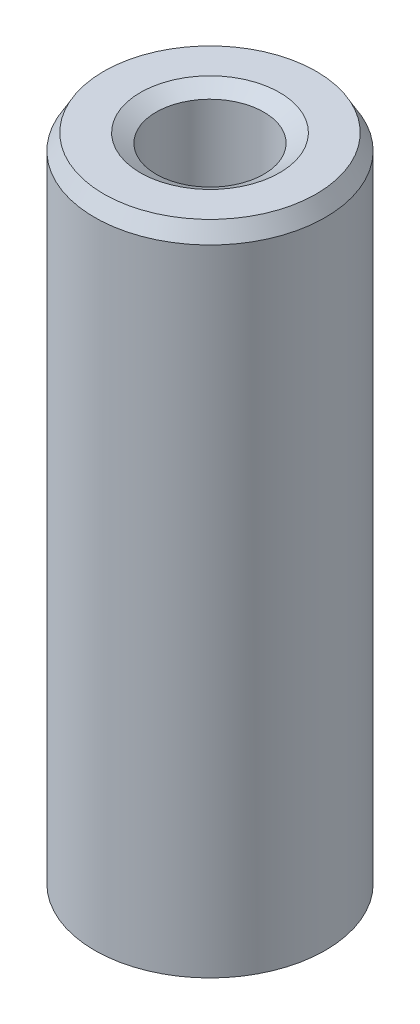
ISO-10303-21;
HEADER;
FILE_DESCRIPTION(('STEP AP214'),'2;1');
FILE_NAME('part.step','',(''),(''),'','','');
FILE_SCHEMA(('AUTOMOTIVE_DESIGN { 1 0 10303 214 1 1 1 1 }'));
ENDSEC;
DATA;
#1=APPLICATION_CONTEXT('core data for automotive mechanical design processes');
#2=APPLICATION_PROTOCOL_DEFINITION('international standard','automotive_design',2000,#1);
#3=PRODUCT_CONTEXT('',#1,'mechanical');
#4=PRODUCT('Part','Part','',(#3));
#5=PRODUCT_RELATED_PRODUCT_CATEGORY('part','',(#4));
#6=PRODUCT_DEFINITION_FORMATION('','',#4);
#7=PRODUCT_DEFINITION_CONTEXT('part definition',#1,'design');
#8=PRODUCT_DEFINITION('design','',#6,#7);
#9=PRODUCT_DEFINITION_SHAPE('','',#8);
#10=(LENGTH_UNIT() NAMED_UNIT(*) SI_UNIT(.MILLI.,.METRE.));
#11=(NAMED_UNIT(*) PLANE_ANGLE_UNIT() SI_UNIT($,.RADIAN.));
#12=(NAMED_UNIT(*) SI_UNIT($,.STERADIAN.) SOLID_ANGLE_UNIT());
#13=UNCERTAINTY_MEASURE_WITH_UNIT(LENGTH_MEASURE(1.E-05),#10,'distance_accuracy_value','');
#14=(GEOMETRIC_REPRESENTATION_CONTEXT(3) GLOBAL_UNCERTAINTY_ASSIGNED_CONTEXT((#13)) GLOBAL_UNIT_ASSIGNED_CONTEXT((#10,
#11,#12)) REPRESENTATION_CONTEXT('',''));
#15=CARTESIAN_POINT('',(0.,0.,0.));
#16=DIRECTION('',(0.,0.,1.));
#17=DIRECTION('',(1.,0.,0.));
#18=AXIS2_PLACEMENT_3D('',#15,#16,#17);
#19=CARTESIAN_POINT('',(0.,28.5897561226494,0.));
#20=DIRECTION('',(0.,-1.,0.));
#21=DIRECTION('',(0.,0.,-1.));
#22=AXIS2_PLACEMENT_3D('',#19,#20,#21);
#23=CYLINDRICAL_SURFACE('',#22,5.);
#24=CARTESIAN_POINT('',(0.,0.394438370758168,0.));
#25=DIRECTION('',(0.,1.,0.));
#26=DIRECTION('',(0.,0.,1.));
#27=AXIS2_PLACEMENT_3D('',#24,#25,#26);
#28=CIRCLE('',#27,5.);
#29=CARTESIAN_POINT('',(0.,0.394438370758168,5.));
#30=VERTEX_POINT('',#29);
#31=EDGE_CURVE('E10',#30,#30,#28,.T.);
#32=ORIENTED_EDGE('',*,*,#31,.T.);
#33=EDGE_LOOP('',(#32));
#34=FACE_BOUND('',#33,.T.);
#35=CARTESIAN_POINT('',(0.,27.9065688240416,0.));
#36=DIRECTION('',(0.,1.,0.));
#37=DIRECTION('',(0.,0.,1.));
#38=AXIS2_PLACEMENT_3D('',#35,#36,#37);
#39=CIRCLE('',#38,5.);
#40=CARTESIAN_POINT('',(0.,27.9065688240416,-5.));
#41=VERTEX_POINT('',#40);
#42=EDGE_CURVE('E50',#41,#41,#39,.F.);
#43=ORIENTED_EDGE('',*,*,#42,.T.);
#44=EDGE_LOOP('',(#43));
#45=FACE_BOUND('',#44,.T.);
#46=ADVANCED_FACE('F39',(#34,#45),#23,.T.);
#47=CARTESIAN_POINT('',(0.,28.5897561226494,0.));
#48=DIRECTION('',(0.,1.,0.));
#49=DIRECTION('',(0.,0.,1.));
#50=AXIS2_PLACEMENT_3D('',#47,#48,#49);
#51=PLANE('',#50);
#52=CARTESIAN_POINT('',(0.,28.5897561226494,0.));
#53=DIRECTION('',(0.,1.,0.));
#54=DIRECTION('',(0.,0.,1.));
#55=AXIS2_PLACEMENT_3D('',#52,#53,#54);
#56=CIRCLE('',#55,3.01723917151664);
#57=CARTESIAN_POINT('',(0.,28.5897561226494,3.01723917151664));
#58=VERTEX_POINT('',#57);
#59=EDGE_CURVE('E58',#58,#58,#56,.F.);
#60=ORIENTED_EDGE('',*,*,#59,.T.);
#61=EDGE_LOOP('',(#60));
#62=FACE_BOUND('',#61,.T.);
#63=CARTESIAN_POINT('',(0.,28.5897561226494,0.));
#64=DIRECTION('',(0.,1.,0.));
#65=DIRECTION('',(0.,0.,1.));
#66=AXIS2_PLACEMENT_3D('',#63,#64,#65);
#67=CIRCLE('',#66,4.60556162924183);
#68=CARTESIAN_POINT('',(0.,28.5897561226494,-4.60556162924183));
#69=VERTEX_POINT('',#68);
#70=EDGE_CURVE('E61',#69,#69,#67,.T.);
#71=ORIENTED_EDGE('',*,*,#70,.T.);
#72=EDGE_LOOP('',(#71));
#73=FACE_BOUND('',#72,.T.);
#74=ADVANCED_FACE('F88',(#62,#73),#51,.T.);
#75=CARTESIAN_POINT('',(0.,0.,0.));
#76=DIRECTION('',(0.,1.,0.));
#77=DIRECTION('',(0.,0.,1.));
#78=AXIS2_PLACEMENT_3D('',#75,#76,#77);
#79=PLANE('',#78);
#80=CARTESIAN_POINT('',(0.,0.,0.));
#81=DIRECTION('',(0.,1.,0.));
#82=DIRECTION('',(0.,0.,1.));
#83=AXIS2_PLACEMENT_3D('',#80,#81,#82);
#84=CIRCLE('',#83,2.72849024366697);
#85=CARTESIAN_POINT('',(0.,0.,2.72849024366697));
#86=VERTEX_POINT('',#85);
#87=EDGE_CURVE('E51',#86,#86,#84,.T.);
#88=ORIENTED_EDGE('',*,*,#87,.T.);
#89=EDGE_LOOP('',(#88));
#90=FACE_BOUND('',#89,.T.);
#91=CARTESIAN_POINT('',(0.,0.,0.));
#92=DIRECTION('',(0.,1.,0.));
#93=DIRECTION('',(0.,0.,1.));
#94=AXIS2_PLACEMENT_3D('',#91,#92,#93);
#95=CIRCLE('',#94,4.31681270139216);
#96=CARTESIAN_POINT('',(0.,0.,4.31681270139216));
#97=VERTEX_POINT('',#96);
#98=EDGE_CURVE('E54',#97,#97,#95,.F.);
#99=ORIENTED_EDGE('',*,*,#98,.T.);
#100=EDGE_LOOP('',(#99));
#101=FACE_BOUND('',#100,.T.);
#102=ADVANCED_FACE('F83',(#90,#101),#79,.F.);
#103=CARTESIAN_POINT('',(0.,28.5897561226494,0.));
#104=DIRECTION('',(0.,-1.,0.));
#105=DIRECTION('',(0.,0.,-1.));
#106=AXIS2_PLACEMENT_3D('',#103,#104,#105);
#107=CYLINDRICAL_SURFACE('',#106,2.3340518729088);
#108=CARTESIAN_POINT('',(0.,28.1953177518913,0.));
#109=DIRECTION('',(0.,1.,0.));
#110=DIRECTION('',(0.,0.,1.));
#111=AXIS2_PLACEMENT_3D('',#108,#109,#110);
#112=CIRCLE('',#111,2.3340518729088);
#113=CARTESIAN_POINT('',(0.,28.1953177518913,2.3340518729088));
#114=VERTEX_POINT('',#113);
#115=EDGE_CURVE('E67',#114,#114,#112,.T.);
#116=ORIENTED_EDGE('',*,*,#115,.T.);
#117=EDGE_LOOP('',(#116));
#118=FACE_BOUND('',#117,.T.);
#119=CARTESIAN_POINT('',(0.,0.683187298607842,0.));
#120=DIRECTION('',(0.,1.,0.));
#121=DIRECTION('',(0.,0.,1.));
#122=AXIS2_PLACEMENT_3D('',#119,#120,#121);
#123=CIRCLE('',#122,2.3340518729088);
#124=CARTESIAN_POINT('',(0.,0.683187298607842,2.3340518729088));
#125=VERTEX_POINT('',#124);
#126=EDGE_CURVE('E69',#125,#125,#123,.F.);
#127=ORIENTED_EDGE('',*,*,#126,.T.);
#128=EDGE_LOOP('',(#127));
#129=FACE_BOUND('',#128,.T.);
#130=ADVANCED_FACE('F71',(#118,#129),#107,.F.);
#131=CARTESIAN_POINT('',(0.,28.1953177518913,0.));
#132=DIRECTION('',(0.,1.,0.));
#133=DIRECTION('',(0.,0.,1.));
#134=AXIS2_PLACEMENT_3D('',#131,#132,#133);
#135=CONICAL_SURFACE('',#134,2.3340518729088,1.0471975511966);
#136=ORIENTED_EDGE('',*,*,#59,.F.);
#137=EDGE_LOOP('',(#136));
#138=FACE_BOUND('',#137,.T.);
#139=ORIENTED_EDGE('',*,*,#115,.F.);
#140=EDGE_LOOP('',(#139));
#141=FACE_BOUND('',#140,.T.);
#142=ADVANCED_FACE('F77',(#138,#141),#135,.F.);
#143=CARTESIAN_POINT('',(0.,0.,0.));
#144=DIRECTION('',(0.,-1.,0.));
#145=DIRECTION('',(0.,0.,-1.));
#146=AXIS2_PLACEMENT_3D('',#143,#144,#145);
#147=CONICAL_SURFACE('',#146,2.72849024366697,0.523598775598297);
#148=ORIENTED_EDGE('',*,*,#126,.F.);
#149=EDGE_LOOP('',(#148));
#150=FACE_BOUND('',#149,.T.);
#151=ORIENTED_EDGE('',*,*,#87,.F.);
#152=EDGE_LOOP('',(#151));
#153=FACE_BOUND('',#152,.T.);
#154=ADVANCED_FACE('F73',(#150,#153),#147,.F.);
#155=CARTESIAN_POINT('',(0.,0.394438370758168,0.));
#156=DIRECTION('',(0.,1.,0.));
#157=DIRECTION('',(0.,0.,1.));
#158=AXIS2_PLACEMENT_3D('',#155,#156,#157);
#159=CONICAL_SURFACE('',#158,5.,1.0471975511966);
#160=ORIENTED_EDGE('',*,*,#98,.F.);
#161=EDGE_LOOP('',(#160));
#162=FACE_BOUND('',#161,.T.);
#163=ORIENTED_EDGE('',*,*,#31,.F.);
#164=EDGE_LOOP('',(#163));
#165=FACE_BOUND('',#164,.T.);
#166=ADVANCED_FACE('F76',(#162,#165),#159,.T.);
#167=CARTESIAN_POINT('',(0.,28.5897561226494,0.));
#168=DIRECTION('',(0.,-1.,0.));
#169=DIRECTION('',(0.,0.,-1.));
#170=AXIS2_PLACEMENT_3D('',#167,#168,#169);
#171=CONICAL_SURFACE('',#170,4.60556162924183,0.523598775598294);
#172=CARTESIAN_POINT('',(0.,27.9065688240416,-5.));
#173=CARTESIAN_POINT('',(0.,27.9136853584021,-4.99589126697127));
#174=CARTESIAN_POINT('',(0.,27.9208018927626,-4.99178253394254));
#175=CARTESIAN_POINT('',(0.,27.9350349614836,-4.98356506788508));
#176=CARTESIAN_POINT('',(0.,27.9421514958441,-4.97945633485635));
#177=CARTESIAN_POINT('',(0.,27.9563845645651,-4.97123886879888));
#178=CARTESIAN_POINT('',(0.,27.9635010989256,-4.96713013577015));
#179=CARTESIAN_POINT('',(0.,27.9777341676466,-4.95891266971269));
#180=CARTESIAN_POINT('',(0.,27.9848507020071,-4.95480393668396));
#181=CARTESIAN_POINT('',(0.,27.9990837707281,-4.9465864706265));
#182=CARTESIAN_POINT('',(0.,28.0062003050886,-4.94247773759777));
#183=CARTESIAN_POINT('',(0.,28.0204333738096,-4.93426027154031));
#184=CARTESIAN_POINT('',(0.,28.0275499081701,-4.93015153851157));
#185=CARTESIAN_POINT('',(0.,28.0417829768911,-4.92193407245411));
#186=CARTESIAN_POINT('',(0.,28.0488995112516,-4.91782533942538));
#187=CARTESIAN_POINT('',(0.,28.0631325799725,-4.90960787336792));
#188=CARTESIAN_POINT('',(0.,28.0702491143331,-4.90549914033919));
#189=CARTESIAN_POINT('',(0.,28.084482183054,-4.89728167428173));
#190=CARTESIAN_POINT('',(0.,28.0915987174145,-4.893172941253));
#191=CARTESIAN_POINT('',(0.,28.1058317861355,-4.88495547519554));
#192=CARTESIAN_POINT('',(0.,28.112948320496,-4.8808467421668));
#193=CARTESIAN_POINT('',(0.,28.127181389217,-4.87262927610934));
#194=CARTESIAN_POINT('',(0.,28.1342979235775,-4.86852054308061));
#195=CARTESIAN_POINT('',(0.,28.1485309922985,-4.86030307702315));
#196=CARTESIAN_POINT('',(0.,28.155647526659,-4.85619434399442));
#197=CARTESIAN_POINT('',(0.,28.16988059538,-4.84797687793696));
#198=CARTESIAN_POINT('',(0.,28.1769971297405,-4.84386814490823));
#199=CARTESIAN_POINT('',(0.,28.1912301984615,-4.83565067885076));
#200=CARTESIAN_POINT('',(0.,28.198346732822,-4.83154194582203));
#201=CARTESIAN_POINT('',(0.,28.212579801543,-4.82332447976457));
#202=CARTESIAN_POINT('',(0.,28.2196963359035,-4.81921574673584));
#203=CARTESIAN_POINT('',(0.,28.2339294046245,-4.81099828067838));
#204=CARTESIAN_POINT('',(0.,28.241045938985,-4.80688954764965));
#205=CARTESIAN_POINT('',(0.,28.255279007706,-4.79867208159219));
#206=CARTESIAN_POINT('',(0.,28.2623955420665,-4.79456334856345));
#207=CARTESIAN_POINT('',(0.,28.2766286107875,-4.78634588250599));
#208=CARTESIAN_POINT('',(0.,28.283745145148,-4.78223714947726));
#209=CARTESIAN_POINT('',(0.,28.297978213869,-4.7740196834198));
#210=CARTESIAN_POINT('',(0.,28.3050947482295,-4.76991095039107));
#211=CARTESIAN_POINT('',(0.,28.3193278169505,-4.76169348433361));
#212=CARTESIAN_POINT('',(0.,28.326444351311,-4.75758475130488));
#213=CARTESIAN_POINT('',(0.,28.340677420032,-4.74936728524741));
#214=CARTESIAN_POINT('',(0.,28.3477939543925,-4.74525855221868));
#215=CARTESIAN_POINT('',(0.,28.3620270231135,-4.73704108616122));
#216=CARTESIAN_POINT('',(0.,28.369143557474,-4.73293235313249));
#217=CARTESIAN_POINT('',(0.,28.383376626195,-4.72471488707503));
#218=CARTESIAN_POINT('',(0.,28.3904931605555,-4.7206061540463));
#219=CARTESIAN_POINT('',(0.,28.4047262292765,-4.71238868798883));
#220=CARTESIAN_POINT('',(0.,28.411842763637,-4.7082799549601));
#221=CARTESIAN_POINT('',(0.,28.426075832358,-4.70006248890264));
#222=CARTESIAN_POINT('',(0.,28.4331923667185,-4.69595375587391));
#223=CARTESIAN_POINT('',(0.,28.4474254354395,-4.68773628981645));
#224=CARTESIAN_POINT('',(0.,28.4545419698,-4.68362755678772));
#225=CARTESIAN_POINT('',(0.,28.468775038521,-4.67541009073026));
#226=CARTESIAN_POINT('',(0.,28.4758915728815,-4.67130135770153));
#227=CARTESIAN_POINT('',(0.,28.4901246416025,-4.66308389164406));
#228=CARTESIAN_POINT('',(0.,28.497241175963,-4.65897515861533));
#229=CARTESIAN_POINT('',(0.,28.511474244684,-4.65075769255787));
#230=CARTESIAN_POINT('',(0.,28.5185907790445,-4.64664895952914));
#231=CARTESIAN_POINT('',(0.,28.5328238477654,-4.63843149347168));
#232=CARTESIAN_POINT('',(0.,28.5399403821259,-4.63432276044295));
#233=CARTESIAN_POINT('',(0.,28.5541734508469,-4.62610529438549));
#234=CARTESIAN_POINT('',(0.,28.5612899852074,-4.62199656135675));
#235=CARTESIAN_POINT('',(0.,28.5755230539284,-4.61377909529929));
#236=CARTESIAN_POINT('',(0.,28.5826395882889,-4.60967036227056));
#237=CARTESIAN_POINT('',(0.,28.5897561226494,-4.60556162924183));
#238=B_SPLINE_CURVE_WITH_KNOTS('',3,(#172,#173,#174,#175,#176,#177,#178,#179,#180,#181,#182,
#183,#184,#185,#186,#187,#188,#189,#190,#191,#192,#193,#194,#195,#196,#197,#198,#199,#200,#201,
#202,#203,#204,#205,#206,#207,#208,#209,#210,#211,#212,#213,#214,#215,#216,#217,#218,#219,#220,
#221,#222,#223,#224,#225,#226,#227,#228,#229,#230,#231,#232,#233,#234,#235,#236,#237),
.UNSPECIFIED.,.F.,.F.,(4,2,2,2,2,2,2,2,2,2,2,2,2,2,2,2,2,2,2,2,2,2,2,2,2,2,2,2,2,2,2,2,4),(0.,
0.0246523981723855,0.049304796344771,0.0739571945171564,0.0986095926895419,0.123261990861927,
0.147914389034313,0.172566787206698,0.197219185379087,0.221871583551472,0.246523981723858,
0.271176379896243,0.295828778068629,0.320481176241014,0.345133574413399,0.369785972585785,
0.394438370758173,0.419090768930559,0.443743167102944,0.46839556527533,0.493047963447715,
0.517700361620101,0.542352759792486,0.567005157964872,0.59165755613726,0.616309954309646,
0.640962352482031,0.665614750654417,0.690267148826802,0.714919546999188,0.739571945171573,
0.764224343343959,0.788876741516347),.UNSPECIFIED.);
#239=EDGE_CURVE('BSEAM45',#41,#69,#238,.T.);
#240=ORIENTED_EDGE('',*,*,#42,.F.);
#241=ORIENTED_EDGE('',*,*,#70,.F.);
#242=ORIENTED_EDGE('',*,*,#239,.T.);
#243=ORIENTED_EDGE('',*,*,#239,.F.);
#244=EDGE_LOOP('',(#240,#242,#241,#243));
#245=FACE_BOUND('',#244,.T.);
#246=ADVANCED_FACE('F45',(#245),#171,.T.);
#247=CLOSED_SHELL('',(#46,#74,#102,#130,#142,#154,#166,#246));
#248=MANIFOLD_SOLID_BREP('B2',#247);
#249=ADVANCED_BREP_SHAPE_REPRESENTATION('',(#18,#248),#14);
#250=SHAPE_DEFINITION_REPRESENTATION(#9,#249);
ENDSEC;
END-ISO-10303-21;
